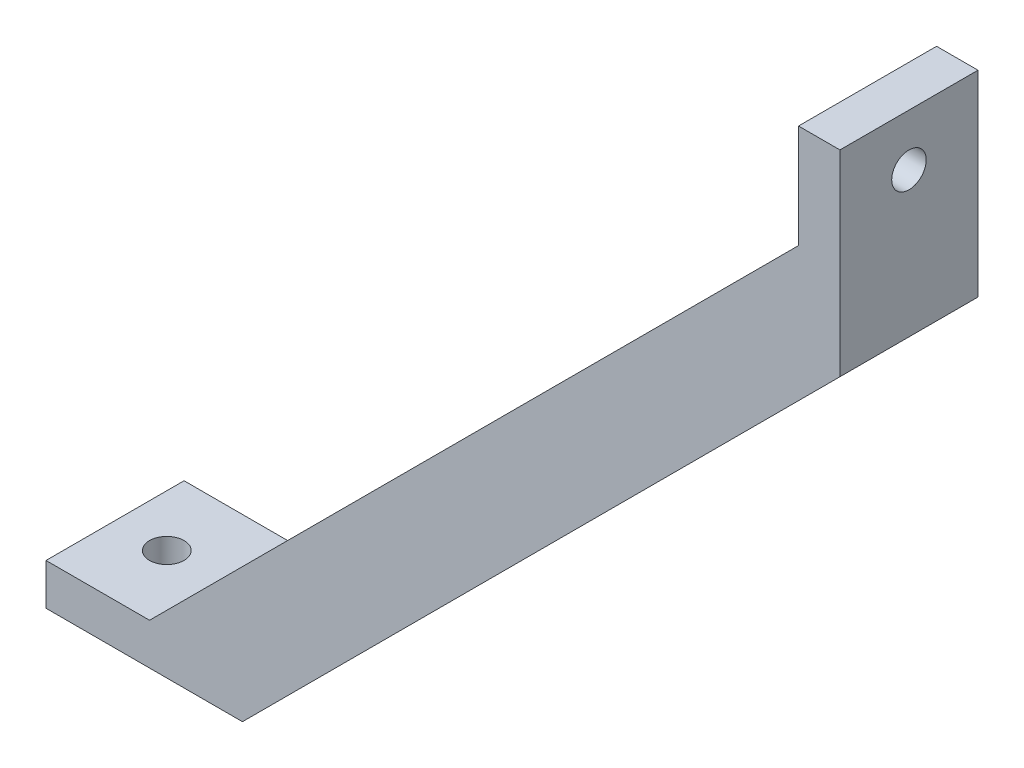
ISO-10303-21;
HEADER;
FILE_DESCRIPTION(('STEP AP214'),'2;1');
FILE_NAME('part.step','',(''),(''),'','','');
FILE_SCHEMA(('AUTOMOTIVE_DESIGN { 1 0 10303 214 1 1 1 1 }'));
ENDSEC;
DATA;
#1=APPLICATION_CONTEXT('core data for automotive mechanical design processes');
#2=APPLICATION_PROTOCOL_DEFINITION('international standard','automotive_design',2000,#1);
#3=PRODUCT_CONTEXT('',#1,'mechanical');
#4=PRODUCT('Part','Part','',(#3));
#5=PRODUCT_RELATED_PRODUCT_CATEGORY('part','',(#4));
#6=PRODUCT_DEFINITION_FORMATION('','',#4);
#7=PRODUCT_DEFINITION_CONTEXT('part definition',#1,'design');
#8=PRODUCT_DEFINITION('design','',#6,#7);
#9=PRODUCT_DEFINITION_SHAPE('','',#8);
#10=(LENGTH_UNIT() NAMED_UNIT(*) SI_UNIT(.MILLI.,.METRE.));
#11=(NAMED_UNIT(*) PLANE_ANGLE_UNIT() SI_UNIT($,.RADIAN.));
#12=(NAMED_UNIT(*) SI_UNIT($,.STERADIAN.) SOLID_ANGLE_UNIT());
#13=UNCERTAINTY_MEASURE_WITH_UNIT(LENGTH_MEASURE(1.E-05),#10,'distance_accuracy_value','');
#14=(GEOMETRIC_REPRESENTATION_CONTEXT(3) GLOBAL_UNCERTAINTY_ASSIGNED_CONTEXT((#13)) GLOBAL_UNIT_ASSIGNED_CONTEXT((#10,
#11,#12)) REPRESENTATION_CONTEXT('',''));
#15=CARTESIAN_POINT('',(0.,0.,0.));
#16=DIRECTION('',(0.,0.,1.));
#17=DIRECTION('',(1.,0.,0.));
#18=AXIS2_PLACEMENT_3D('',#15,#16,#17);
#19=CARTESIAN_POINT('',(0.,115.,20.));
#20=DIRECTION('',(-1.,0.,0.));
#21=DIRECTION('',(0.,0.,1.));
#22=AXIS2_PLACEMENT_3D('',#19,#20,#21);
#23=PLANE('',#22);
#24=CARTESIAN_POINT('',(0.,107.5,10.));
#25=DIRECTION('',(-1.,0.,0.));
#26=DIRECTION('',(0.,0.,1.));
#27=AXIS2_PLACEMENT_3D('',#24,#25,#26);
#28=CIRCLE('',#27,2.5);
#29=CARTESIAN_POINT('',(0.,107.5,12.5));
#30=VERTEX_POINT('',#29);
#31=EDGE_CURVE('E148',#30,#30,#28,.T.);
#32=ORIENTED_EDGE('',*,*,#31,.T.);
#33=EDGE_LOOP('',(#32));
#34=FACE_BOUND('',#33,.T.);
#35=DIRECTION('',(0.,1.,0.));
#36=VECTOR('',#35,1.);
#37=CARTESIAN_POINT('',(0.,115.,0.));
#38=LINE('',#37,#36);
#39=CARTESIAN_POINT('',(0.,86.5411341437557,0.));
#40=VERTEX_POINT('',#39);
#41=CARTESIAN_POINT('',(0.,115.,0.));
#42=VERTEX_POINT('',#41);
#43=EDGE_CURVE('E143',#40,#42,#38,.T.);
#44=ORIENTED_EDGE('',*,*,#43,.T.);
#45=DIRECTION('',(0.,0.,-1.));
#46=VECTOR('',#45,1.);
#47=CARTESIAN_POINT('',(0.,115.,20.));
#48=LINE('',#47,#46);
#49=CARTESIAN_POINT('',(0.,115.,20.));
#50=VERTEX_POINT('',#49);
#51=EDGE_CURVE('E11',#50,#42,#48,.T.);
#52=ORIENTED_EDGE('',*,*,#51,.F.);
#53=DIRECTION('',(0.,1.,0.));
#54=VECTOR('',#53,1.);
#55=CARTESIAN_POINT('',(0.,115.,20.));
#56=LINE('',#55,#54);
#57=CARTESIAN_POINT('',(0.,86.5411341437557,20.));
#58=VERTEX_POINT('',#57);
#59=EDGE_CURVE('E166',#58,#50,#56,.T.);
#60=ORIENTED_EDGE('',*,*,#59,.F.);
#61=DIRECTION('',(0.,0.,-1.));
#62=VECTOR('',#61,1.);
#63=CARTESIAN_POINT('',(0.,86.5411341437557,20.));
#64=LINE('',#63,#62);
#65=EDGE_CURVE('E139',#58,#40,#64,.T.);
#66=ORIENTED_EDGE('',*,*,#65,.T.);
#67=EDGE_LOOP('',(#44,#52,#60,#66));
#68=FACE_BOUND('',#67,.T.);
#69=ADVANCED_FACE('F41',(#34,#68),#23,.F.);
#70=CARTESIAN_POINT('',(0.,115.,20.));
#71=DIRECTION('',(0.,-1.,0.));
#72=DIRECTION('',(0.,0.,-1.));
#73=AXIS2_PLACEMENT_3D('',#70,#71,#72);
#74=PLANE('',#73);
#75=DIRECTION('',(-1.,0.,0.));
#76=VECTOR('',#75,1.);
#77=CARTESIAN_POINT('',(0.,115.,0.));
#78=LINE('',#77,#76);
#79=CARTESIAN_POINT('',(-6.,115.,0.));
#80=VERTEX_POINT('',#79);
#81=EDGE_CURVE('E147',#42,#80,#78,.T.);
#82=ORIENTED_EDGE('',*,*,#81,.T.);
#83=DIRECTION('',(0.,0.,-1.));
#84=VECTOR('',#83,1.);
#85=CARTESIAN_POINT('',(-6.,115.,20.));
#86=LINE('',#85,#84);
#87=CARTESIAN_POINT('',(-6.,115.,20.));
#88=VERTEX_POINT('',#87);
#89=EDGE_CURVE('E51',#88,#80,#86,.T.);
#90=ORIENTED_EDGE('',*,*,#89,.F.);
#91=DIRECTION('',(-1.,0.,0.));
#92=VECTOR('',#91,1.);
#93=CARTESIAN_POINT('',(0.,115.,20.));
#94=LINE('',#93,#92);
#95=EDGE_CURVE('E102',#50,#88,#94,.T.);
#96=ORIENTED_EDGE('',*,*,#95,.F.);
#97=ORIENTED_EDGE('',*,*,#51,.T.);
#98=EDGE_LOOP('',(#82,#90,#96,#97));
#99=FACE_BOUND('',#98,.T.);
#100=ADVANCED_FACE('F238',(#99),#74,.F.);
#101=CARTESIAN_POINT('',(-6.,115.,20.));
#102=DIRECTION('',(1.,0.,0.));
#103=DIRECTION('',(0.,1.,0.));
#104=AXIS2_PLACEMENT_3D('',#101,#102,#103);
#105=PLANE('',#104);
#106=CARTESIAN_POINT('',(-6.,107.5,10.));
#107=DIRECTION('',(-1.,0.,0.));
#108=DIRECTION('',(0.,-1.,0.));
#109=AXIS2_PLACEMENT_3D('',#106,#107,#108);
#110=CIRCLE('',#109,2.5);
#111=CARTESIAN_POINT('',(-6.,105.,10.));
#112=VERTEX_POINT('',#111);
#113=EDGE_CURVE('E214',#112,#112,#110,.T.);
#114=ORIENTED_EDGE('',*,*,#113,.F.);
#115=EDGE_LOOP('',(#114));
#116=FACE_BOUND('',#115,.T.);
#117=DIRECTION('',(0.,-1.,0.));
#118=VECTOR('',#117,1.);
#119=CARTESIAN_POINT('',(-6.,115.,0.));
#120=LINE('',#119,#118);
#121=CARTESIAN_POINT('',(-6.,100.,0.));
#122=VERTEX_POINT('',#121);
#123=EDGE_CURVE('E151',#80,#122,#120,.T.);
#124=ORIENTED_EDGE('',*,*,#123,.T.);
#125=DIRECTION('',(0.,0.,-1.));
#126=VECTOR('',#125,1.);
#127=CARTESIAN_POINT('',(-6.,100.,20.));
#128=LINE('',#127,#126);
#129=CARTESIAN_POINT('',(-6.,100.,20.));
#130=VERTEX_POINT('',#129);
#131=EDGE_CURVE('E177',#130,#122,#128,.T.);
#132=ORIENTED_EDGE('',*,*,#131,.F.);
#133=DIRECTION('',(0.,-1.,0.));
#134=VECTOR('',#133,1.);
#135=CARTESIAN_POINT('',(-6.,115.,20.));
#136=LINE('',#135,#134);
#137=EDGE_CURVE('E188',#88,#130,#136,.T.);
#138=ORIENTED_EDGE('',*,*,#137,.F.);
#139=ORIENTED_EDGE('',*,*,#89,.T.);
#140=EDGE_LOOP('',(#124,#132,#138,#139));
#141=FACE_BOUND('',#140,.T.);
#142=ADVANCED_FACE('F186',(#116,#141),#105,.F.);
#143=CARTESIAN_POINT('',(-100.,5.99999999999999,20.));
#144=DIRECTION('',(0.707106781186548,-0.707106781186547,0.));
#145=DIRECTION('',(0.707106781186547,0.707106781186548,0.));
#146=AXIS2_PLACEMENT_3D('',#143,#144,#145);
#147=PLANE('',#146);
#148=DIRECTION('',(-0.707106781186547,-0.707106781186548,0.));
#149=VECTOR('',#148,1.);
#150=CARTESIAN_POINT('',(-100.,5.99999999999999,0.));
#151=LINE('',#150,#149);
#152=CARTESIAN_POINT('',(-100.,5.99999999999999,0.));
#153=VERTEX_POINT('',#152);
#154=EDGE_CURVE('E154',#122,#153,#151,.T.);
#155=ORIENTED_EDGE('',*,*,#154,.T.);
#156=DIRECTION('',(0.,0.,-1.));
#157=VECTOR('',#156,1.);
#158=CARTESIAN_POINT('',(-100.,5.99999999999999,20.));
#159=LINE('',#158,#157);
#160=CARTESIAN_POINT('',(-100.,5.99999999999999,20.));
#161=VERTEX_POINT('',#160);
#162=EDGE_CURVE('E173',#161,#153,#159,.T.);
#163=ORIENTED_EDGE('',*,*,#162,.F.);
#164=DIRECTION('',(-0.707106781186547,-0.707106781186548,0.));
#165=VECTOR('',#164,1.);
#166=CARTESIAN_POINT('',(-100.,5.99999999999999,20.));
#167=LINE('',#166,#165);
#168=EDGE_CURVE('E201',#130,#161,#167,.T.);
#169=ORIENTED_EDGE('',*,*,#168,.F.);
#170=ORIENTED_EDGE('',*,*,#131,.T.);
#171=EDGE_LOOP('',(#155,#163,#169,#170));
#172=FACE_BOUND('',#171,.T.);
#173=ADVANCED_FACE('F196',(#172),#147,.F.);
#174=CARTESIAN_POINT('',(-115.,5.99999999999999,20.));
#175=DIRECTION('',(0.,-1.,0.));
#176=DIRECTION('',(0.,0.,-1.));
#177=AXIS2_PLACEMENT_3D('',#174,#175,#176);
#178=PLANE('',#177);
#179=CARTESIAN_POINT('',(-107.5,5.99999999999999,10.));
#180=DIRECTION('',(0.,1.,0.));
#181=DIRECTION('',(0.,0.,1.));
#182=AXIS2_PLACEMENT_3D('',#179,#180,#181);
#183=CIRCLE('',#182,2.5);
#184=CARTESIAN_POINT('',(-107.5,5.99999999999999,12.5));
#185=VERTEX_POINT('',#184);
#186=EDGE_CURVE('E218',#185,#185,#183,.T.);
#187=ORIENTED_EDGE('',*,*,#186,.F.);
#188=EDGE_LOOP('',(#187));
#189=FACE_BOUND('',#188,.T.);
#190=DIRECTION('',(-1.,0.,0.));
#191=VECTOR('',#190,1.);
#192=CARTESIAN_POINT('',(-115.,5.99999999999999,0.));
#193=LINE('',#192,#191);
#194=CARTESIAN_POINT('',(-115.,5.99999999999999,0.));
#195=VERTEX_POINT('',#194);
#196=EDGE_CURVE('E157',#153,#195,#193,.T.);
#197=ORIENTED_EDGE('',*,*,#196,.T.);
#198=DIRECTION('',(0.,0.,-1.));
#199=VECTOR('',#198,1.);
#200=CARTESIAN_POINT('',(-115.,5.99999999999999,20.));
#201=LINE('',#200,#199);
#202=CARTESIAN_POINT('',(-115.,5.99999999999999,20.));
#203=VERTEX_POINT('',#202);
#204=EDGE_CURVE('E132',#203,#195,#201,.T.);
#205=ORIENTED_EDGE('',*,*,#204,.F.);
#206=DIRECTION('',(-1.,0.,0.));
#207=VECTOR('',#206,1.);
#208=CARTESIAN_POINT('',(-115.,5.99999999999999,20.));
#209=LINE('',#208,#207);
#210=EDGE_CURVE('E121',#161,#203,#209,.T.);
#211=ORIENTED_EDGE('',*,*,#210,.F.);
#212=ORIENTED_EDGE('',*,*,#162,.T.);
#213=EDGE_LOOP('',(#197,#205,#211,#212));
#214=FACE_BOUND('',#213,.T.);
#215=ADVANCED_FACE('F199',(#189,#214),#178,.F.);
#216=CARTESIAN_POINT('',(-115.,0.,20.));
#217=DIRECTION('',(1.,0.,0.));
#218=DIRECTION('',(0.,0.,-1.));
#219=AXIS2_PLACEMENT_3D('',#216,#217,#218);
#220=PLANE('',#219);
#221=DIRECTION('',(0.,-1.,0.));
#222=VECTOR('',#221,1.);
#223=CARTESIAN_POINT('',(-115.,0.,0.));
#224=LINE('',#223,#222);
#225=CARTESIAN_POINT('',(-115.,0.,0.));
#226=VERTEX_POINT('',#225);
#227=EDGE_CURVE('E130',#195,#226,#224,.T.);
#228=ORIENTED_EDGE('',*,*,#227,.T.);
#229=DIRECTION('',(0.,0.,-1.));
#230=VECTOR('',#229,1.);
#231=CARTESIAN_POINT('',(-115.,0.,20.));
#232=LINE('',#231,#230);
#233=CARTESIAN_POINT('',(-115.,0.,20.));
#234=VERTEX_POINT('',#233);
#235=EDGE_CURVE('E127',#234,#226,#232,.T.);
#236=ORIENTED_EDGE('',*,*,#235,.F.);
#237=DIRECTION('',(0.,-1.,0.));
#238=VECTOR('',#237,1.);
#239=CARTESIAN_POINT('',(-115.,0.,20.));
#240=LINE('',#239,#238);
#241=EDGE_CURVE('E115',#203,#234,#240,.T.);
#242=ORIENTED_EDGE('',*,*,#241,.F.);
#243=ORIENTED_EDGE('',*,*,#204,.T.);
#244=EDGE_LOOP('',(#228,#236,#242,#243));
#245=FACE_BOUND('',#244,.T.);
#246=ADVANCED_FACE('F128',(#245),#220,.F.);
#247=CARTESIAN_POINT('',(-115.,0.,20.));
#248=DIRECTION('',(0.,1.,0.));
#249=DIRECTION('',(-1.,0.,0.));
#250=AXIS2_PLACEMENT_3D('',#247,#248,#249);
#251=PLANE('',#250);
#252=CARTESIAN_POINT('',(-107.5,0.,10.));
#253=DIRECTION('',(0.,1.,0.));
#254=DIRECTION('',(-1.,0.,0.));
#255=AXIS2_PLACEMENT_3D('',#252,#253,#254);
#256=CIRCLE('',#255,2.5);
#257=CARTESIAN_POINT('',(-110.,0.,10.));
#258=VERTEX_POINT('',#257);
#259=EDGE_CURVE('E44',#258,#258,#256,.T.);
#260=ORIENTED_EDGE('',*,*,#259,.T.);
#261=EDGE_LOOP('',(#260));
#262=FACE_BOUND('',#261,.T.);
#263=DIRECTION('',(1.,0.,0.));
#264=VECTOR('',#263,1.);
#265=CARTESIAN_POINT('',(-115.,0.,0.));
#266=LINE('',#265,#264);
#267=CARTESIAN_POINT('',(-86.5411341437557,0.,0.));
#268=VERTEX_POINT('',#267);
#269=EDGE_CURVE('E88',#226,#268,#266,.T.);
#270=ORIENTED_EDGE('',*,*,#269,.T.);
#271=DIRECTION('',(0.,0.,-1.));
#272=VECTOR('',#271,1.);
#273=CARTESIAN_POINT('',(-86.5411341437557,0.,20.));
#274=LINE('',#273,#272);
#275=CARTESIAN_POINT('',(-86.5411341437557,0.,20.));
#276=VERTEX_POINT('',#275);
#277=EDGE_CURVE('E133',#276,#268,#274,.T.);
#278=ORIENTED_EDGE('',*,*,#277,.F.);
#279=DIRECTION('',(1.,0.,0.));
#280=VECTOR('',#279,1.);
#281=CARTESIAN_POINT('',(-115.,0.,20.));
#282=LINE('',#281,#280);
#283=EDGE_CURVE('E119',#234,#276,#282,.T.);
#284=ORIENTED_EDGE('',*,*,#283,.F.);
#285=ORIENTED_EDGE('',*,*,#235,.T.);
#286=EDGE_LOOP('',(#270,#278,#284,#285));
#287=FACE_BOUND('',#286,.T.);
#288=ADVANCED_FACE('F135',(#262,#287),#251,.F.);
#289=CARTESIAN_POINT('',(-86.5411341437557,0.,20.));
#290=DIRECTION('',(-0.707106781186548,0.707106781186547,0.));
#291=DIRECTION('',(-0.707106781186547,-0.707106781186548,0.));
#292=AXIS2_PLACEMENT_3D('',#289,#290,#291);
#293=PLANE('',#292);
#294=DIRECTION('',(0.707106781186547,0.707106781186547,0.));
#295=VECTOR('',#294,1.);
#296=CARTESIAN_POINT('',(-86.5411341437557,0.,0.));
#297=LINE('',#296,#295);
#298=EDGE_CURVE('E94',#268,#40,#297,.T.);
#299=ORIENTED_EDGE('',*,*,#298,.T.);
#300=ORIENTED_EDGE('',*,*,#65,.F.);
#301=DIRECTION('',(0.707106781186547,0.707106781186547,0.));
#302=VECTOR('',#301,1.);
#303=CARTESIAN_POINT('',(-86.5411341437557,0.,20.));
#304=LINE('',#303,#302);
#305=EDGE_CURVE('E59',#276,#58,#304,.T.);
#306=ORIENTED_EDGE('',*,*,#305,.F.);
#307=ORIENTED_EDGE('',*,*,#277,.T.);
#308=EDGE_LOOP('',(#299,#300,#306,#307));
#309=FACE_BOUND('',#308,.T.);
#310=ADVANCED_FACE('F247',(#309),#293,.F.);
#311=CARTESIAN_POINT('',(0.,0.,20.));
#312=DIRECTION('',(0.,0.,1.));
#313=DIRECTION('',(1.,0.,0.));
#314=AXIS2_PLACEMENT_3D('',#311,#312,#313);
#315=PLANE('',#314);
#316=ORIENTED_EDGE('',*,*,#59,.T.);
#317=ORIENTED_EDGE('',*,*,#95,.T.);
#318=ORIENTED_EDGE('',*,*,#137,.T.);
#319=ORIENTED_EDGE('',*,*,#168,.T.);
#320=ORIENTED_EDGE('',*,*,#210,.T.);
#321=ORIENTED_EDGE('',*,*,#241,.T.);
#322=ORIENTED_EDGE('',*,*,#283,.T.);
#323=ORIENTED_EDGE('',*,*,#305,.T.);
#324=EDGE_LOOP('',(#316,#317,#318,#319,#320,#321,#322,#323));
#325=FACE_BOUND('',#324,.T.);
#326=ADVANCED_FACE('F117',(#325),#315,.T.);
#327=CARTESIAN_POINT('',(0.,0.,0.));
#328=DIRECTION('',(0.,0.,1.));
#329=DIRECTION('',(1.,0.,0.));
#330=AXIS2_PLACEMENT_3D('',#327,#328,#329);
#331=PLANE('',#330);
#332=ORIENTED_EDGE('',*,*,#43,.F.);
#333=ORIENTED_EDGE('',*,*,#298,.F.);
#334=ORIENTED_EDGE('',*,*,#269,.F.);
#335=ORIENTED_EDGE('',*,*,#227,.F.);
#336=ORIENTED_EDGE('',*,*,#196,.F.);
#337=ORIENTED_EDGE('',*,*,#154,.F.);
#338=ORIENTED_EDGE('',*,*,#123,.F.);
#339=ORIENTED_EDGE('',*,*,#81,.F.);
#340=EDGE_LOOP('',(#332,#333,#334,#335,#336,#337,#338,#339));
#341=FACE_BOUND('',#340,.T.);
#342=ADVANCED_FACE('F192',(#341),#331,.F.);
#343=CARTESIAN_POINT('',(14.,107.5,10.));
#344=DIRECTION('',(-1.,0.,0.));
#345=DIRECTION('',(0.,-1.,0.));
#346=AXIS2_PLACEMENT_3D('',#343,#344,#345);
#347=CYLINDRICAL_SURFACE('',#346,2.5);
#348=ORIENTED_EDGE('',*,*,#113,.T.);
#349=EDGE_LOOP('',(#348));
#350=FACE_BOUND('',#349,.T.);
#351=ORIENTED_EDGE('',*,*,#31,.F.);
#352=EDGE_LOOP('',(#351));
#353=FACE_BOUND('',#352,.T.);
#354=ADVANCED_FACE('F230',(#350,#353),#347,.F.);
#355=CARTESIAN_POINT('',(-107.5,-14.,10.));
#356=DIRECTION('',(0.,1.,0.));
#357=DIRECTION('',(0.,0.,1.));
#358=AXIS2_PLACEMENT_3D('',#355,#356,#357);
#359=CYLINDRICAL_SURFACE('',#358,2.5);
#360=ORIENTED_EDGE('',*,*,#186,.T.);
#361=EDGE_LOOP('',(#360));
#362=FACE_BOUND('',#361,.T.);
#363=ORIENTED_EDGE('',*,*,#259,.F.);
#364=EDGE_LOOP('',(#363));
#365=FACE_BOUND('',#364,.T.);
#366=ADVANCED_FACE('F228',(#362,#365),#359,.F.);
#367=CLOSED_SHELL('',(#69,#100,#142,#173,#215,#246,#288,#310,#326,#342,#354,#366));
#368=MANIFOLD_SOLID_BREP('B2',#367);
#369=ADVANCED_BREP_SHAPE_REPRESENTATION('',(#18,#368),#14);
#370=SHAPE_DEFINITION_REPRESENTATION(#9,#369);
ENDSEC;
END-ISO-10303-21;
